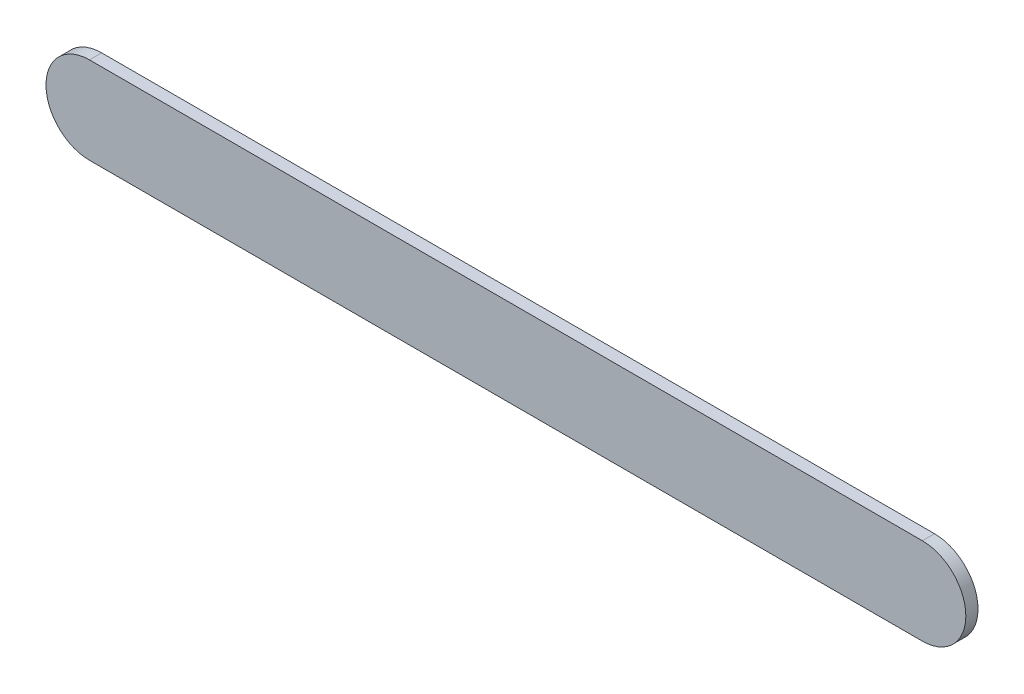
ISO-10303-21;
HEADER;
FILE_DESCRIPTION(('STEP AP214'),'2;1');
FILE_NAME('part.step','',(''),(''),'','','');
FILE_SCHEMA(('AUTOMOTIVE_DESIGN { 1 0 10303 214 1 1 1 1 }'));
ENDSEC;
DATA;
#1=APPLICATION_CONTEXT('core data for automotive mechanical design processes');
#2=APPLICATION_PROTOCOL_DEFINITION('international standard','automotive_design',2000,#1);
#3=PRODUCT_CONTEXT('',#1,'mechanical');
#4=PRODUCT('Part','Part','',(#3));
#5=PRODUCT_RELATED_PRODUCT_CATEGORY('part','',(#4));
#6=PRODUCT_DEFINITION_FORMATION('','',#4);
#7=PRODUCT_DEFINITION_CONTEXT('part definition',#1,'design');
#8=PRODUCT_DEFINITION('design','',#6,#7);
#9=PRODUCT_DEFINITION_SHAPE('','',#8);
#10=(LENGTH_UNIT() NAMED_UNIT(*) SI_UNIT(.MILLI.,.METRE.));
#11=(NAMED_UNIT(*) PLANE_ANGLE_UNIT() SI_UNIT($,.RADIAN.));
#12=(NAMED_UNIT(*) SI_UNIT($,.STERADIAN.) SOLID_ANGLE_UNIT());
#13=UNCERTAINTY_MEASURE_WITH_UNIT(LENGTH_MEASURE(1.E-05),#10,'distance_accuracy_value','');
#14=(GEOMETRIC_REPRESENTATION_CONTEXT(3) GLOBAL_UNCERTAINTY_ASSIGNED_CONTEXT((#13)) GLOBAL_UNIT_ASSIGNED_CONTEXT((#10,
#11,#12)) REPRESENTATION_CONTEXT('',''));
#15=CARTESIAN_POINT('',(0.,0.,0.));
#16=DIRECTION('',(0.,0.,1.));
#17=DIRECTION('',(1.,0.,0.));
#18=AXIS2_PLACEMENT_3D('',#15,#16,#17);
#19=CARTESIAN_POINT('',(79.66576396,94.1599717,0.));
#20=DIRECTION('',(0.,1.,0.));
#21=DIRECTION('',(1.,0.,0.));
#22=AXIS2_PLACEMENT_3D('',#19,#20,#21);
#23=PLANE('',#22);
#24=DIRECTION('',(1.,0.,0.));
#25=VECTOR('',#24,1.);
#26=CARTESIAN_POINT('',(79.66576396,94.1599717,0.03556));
#27=LINE('',#26,#25);
#28=CARTESIAN_POINT('',(79.66576396,94.1599717,0.03556));
#29=VERTEX_POINT('',#28);
#30=CARTESIAN_POINT('',(82.0980451,94.1599717,0.03556));
#31=VERTEX_POINT('',#30);
#32=EDGE_CURVE('E11',#29,#31,#27,.T.);
#33=ORIENTED_EDGE('',*,*,#32,.F.);
#34=DIRECTION('',(0.,0.,1.));
#35=VECTOR('',#34,1.);
#36=CARTESIAN_POINT('',(79.66576396,94.1599717,0.));
#37=LINE('',#36,#35);
#38=CARTESIAN_POINT('',(79.66576396,94.1599717,0.));
#39=VERTEX_POINT('',#38);
#40=EDGE_CURVE('E24',#39,#29,#37,.T.);
#41=ORIENTED_EDGE('',*,*,#40,.F.);
#42=DIRECTION('',(1.,0.,0.));
#43=VECTOR('',#42,1.);
#44=CARTESIAN_POINT('',(79.66576396,94.1599717,0.));
#45=LINE('',#44,#43);
#46=CARTESIAN_POINT('',(82.0980451,94.1599717,0.));
#47=VERTEX_POINT('',#46);
#48=EDGE_CURVE('E75',#39,#47,#45,.T.);
#49=ORIENTED_EDGE('',*,*,#48,.T.);
#50=DIRECTION('',(0.,0.,1.));
#51=VECTOR('',#50,1.);
#52=CARTESIAN_POINT('',(82.0980451,94.1599717,0.));
#53=LINE('',#52,#51);
#54=EDGE_CURVE('E37',#47,#31,#53,.T.);
#55=ORIENTED_EDGE('',*,*,#54,.T.);
#56=EDGE_LOOP('',(#33,#41,#49,#55));
#57=FACE_BOUND('',#56,.T.);
#58=ADVANCED_FACE('F17',(#57),#23,.F.);
#59=CARTESIAN_POINT('',(82.0980451,94.2869717,0.));
#60=DIRECTION('',(0.,0.,-1.));
#61=DIRECTION('',(-1.11896493820492E-13,-1.,0.));
#62=AXIS2_PLACEMENT_3D('',#59,#60,#61);
#63=CYLINDRICAL_SURFACE('',#62,0.126999999999995);
#64=CARTESIAN_POINT('',(82.0980451,94.2869717,0.03556));
#65=DIRECTION('',(0.,0.,1.));
#66=DIRECTION('',(-1.11896493820492E-13,-1.,0.));
#67=AXIS2_PLACEMENT_3D('',#64,#65,#66);
#68=CIRCLE('',#67,0.126999999999995);
#69=CARTESIAN_POINT('',(82.0980451,94.4139717,0.03556));
#70=VERTEX_POINT('',#69);
#71=EDGE_CURVE('E83',#31,#70,#68,.T.);
#72=ORIENTED_EDGE('',*,*,#71,.F.);
#73=ORIENTED_EDGE('',*,*,#54,.F.);
#74=CARTESIAN_POINT('',(82.0980451,94.2869717,0.));
#75=DIRECTION('',(0.,0.,1.));
#76=DIRECTION('',(-1.11896493820492E-13,-1.,0.));
#77=AXIS2_PLACEMENT_3D('',#74,#75,#76);
#78=CIRCLE('',#77,0.126999999999995);
#79=CARTESIAN_POINT('',(82.0980451,94.4139717,0.));
#80=VERTEX_POINT('',#79);
#81=EDGE_CURVE('E81',#47,#80,#78,.T.);
#82=ORIENTED_EDGE('',*,*,#81,.T.);
#83=DIRECTION('',(0.,0.,1.));
#84=VECTOR('',#83,1.);
#85=CARTESIAN_POINT('',(82.0980451,94.4139717,0.));
#86=LINE('',#85,#84);
#87=EDGE_CURVE('E67',#80,#70,#86,.T.);
#88=ORIENTED_EDGE('',*,*,#87,.T.);
#89=EDGE_LOOP('',(#72,#73,#82,#88));
#90=FACE_BOUND('',#89,.T.);
#91=ADVANCED_FACE('F89',(#90),#63,.T.);
#92=CARTESIAN_POINT('',(82.0980451,94.4139717,0.));
#93=DIRECTION('',(0.,-1.,0.));
#94=DIRECTION('',(-1.,0.,0.));
#95=AXIS2_PLACEMENT_3D('',#92,#93,#94);
#96=PLANE('',#95);
#97=DIRECTION('',(-1.,0.,0.));
#98=VECTOR('',#97,1.);
#99=CARTESIAN_POINT('',(82.0980451,94.4139717,0.03556));
#100=LINE('',#99,#98);
#101=CARTESIAN_POINT('',(79.66576396,94.4139717,0.03556));
#102=VERTEX_POINT('',#101);
#103=EDGE_CURVE('E71',#70,#102,#100,.T.);
#104=ORIENTED_EDGE('',*,*,#103,.F.);
#105=ORIENTED_EDGE('',*,*,#87,.F.);
#106=DIRECTION('',(-1.,0.,0.));
#107=VECTOR('',#106,1.);
#108=CARTESIAN_POINT('',(82.0980451,94.4139717,0.));
#109=LINE('',#108,#107);
#110=CARTESIAN_POINT('',(79.66576396,94.4139717,0.));
#111=VERTEX_POINT('',#110);
#112=EDGE_CURVE('E63',#80,#111,#109,.T.);
#113=ORIENTED_EDGE('',*,*,#112,.T.);
#114=DIRECTION('',(0.,0.,1.));
#115=VECTOR('',#114,1.);
#116=CARTESIAN_POINT('',(79.66576396,94.4139717,0.));
#117=LINE('',#116,#115);
#118=EDGE_CURVE('E53',#111,#102,#117,.T.);
#119=ORIENTED_EDGE('',*,*,#118,.T.);
#120=EDGE_LOOP('',(#104,#105,#113,#119));
#121=FACE_BOUND('',#120,.T.);
#122=ADVANCED_FACE('F66',(#121),#96,.F.);
#123=CARTESIAN_POINT('',(79.66576396,94.2869717,0.));
#124=DIRECTION('',(0.,0.,-1.));
#125=DIRECTION('',(1.11896493820492E-13,1.,0.));
#126=AXIS2_PLACEMENT_3D('',#123,#124,#125);
#127=CYLINDRICAL_SURFACE('',#126,0.126999999999991);
#128=CARTESIAN_POINT('',(79.66576396,94.2869717,0.03556));
#129=DIRECTION('',(0.,0.,1.));
#130=DIRECTION('',(1.11896493820492E-13,1.,0.));
#131=AXIS2_PLACEMENT_3D('',#128,#129,#130);
#132=CIRCLE('',#131,0.126999999999991);
#133=EDGE_CURVE('E59',#102,#29,#132,.T.);
#134=ORIENTED_EDGE('',*,*,#133,.F.);
#135=ORIENTED_EDGE('',*,*,#118,.F.);
#136=CARTESIAN_POINT('',(79.66576396,94.2869717,0.));
#137=DIRECTION('',(0.,0.,1.));
#138=DIRECTION('',(1.11896493820492E-13,1.,0.));
#139=AXIS2_PLACEMENT_3D('',#136,#137,#138);
#140=CIRCLE('',#139,0.126999999999991);
#141=EDGE_CURVE('E57',#111,#39,#140,.T.);
#142=ORIENTED_EDGE('',*,*,#141,.T.);
#143=ORIENTED_EDGE('',*,*,#40,.T.);
#144=EDGE_LOOP('',(#134,#135,#142,#143));
#145=FACE_BOUND('',#144,.T.);
#146=ADVANCED_FACE('F55',(#145),#127,.T.);
#147=CARTESIAN_POINT('',(79.66576396,94.1599717,0.));
#148=DIRECTION('',(0.,0.,-1.));
#149=DIRECTION('',(-1.,0.,0.));
#150=AXIS2_PLACEMENT_3D('',#147,#148,#149);
#151=PLANE('',#150);
#152=ORIENTED_EDGE('',*,*,#141,.F.);
#153=ORIENTED_EDGE('',*,*,#112,.F.);
#154=ORIENTED_EDGE('',*,*,#81,.F.);
#155=ORIENTED_EDGE('',*,*,#48,.F.);
#156=EDGE_LOOP('',(#152,#153,#154,#155));
#157=FACE_BOUND('',#156,.T.);
#158=ADVANCED_FACE('F74',(#157),#151,.T.);
#159=CARTESIAN_POINT('',(79.66576396,94.1599717,0.03556));
#160=DIRECTION('',(0.,0.,-1.));
#161=DIRECTION('',(-1.,0.,0.));
#162=AXIS2_PLACEMENT_3D('',#159,#160,#161);
#163=PLANE('',#162);
#164=ORIENTED_EDGE('',*,*,#32,.T.);
#165=ORIENTED_EDGE('',*,*,#71,.T.);
#166=ORIENTED_EDGE('',*,*,#103,.T.);
#167=ORIENTED_EDGE('',*,*,#133,.T.);
#168=EDGE_LOOP('',(#164,#165,#166,#167));
#169=FACE_BOUND('',#168,.T.);
#170=ADVANCED_FACE('F91',(#169),#163,.F.);
#171=CLOSED_SHELL('',(#58,#91,#122,#146,#158,#170));
#172=MANIFOLD_SOLID_BREP('B1',#171);
#173=ADVANCED_BREP_SHAPE_REPRESENTATION('',(#18,#172),#14);
#174=SHAPE_DEFINITION_REPRESENTATION(#9,#173);
ENDSEC;
END-ISO-10303-21;
